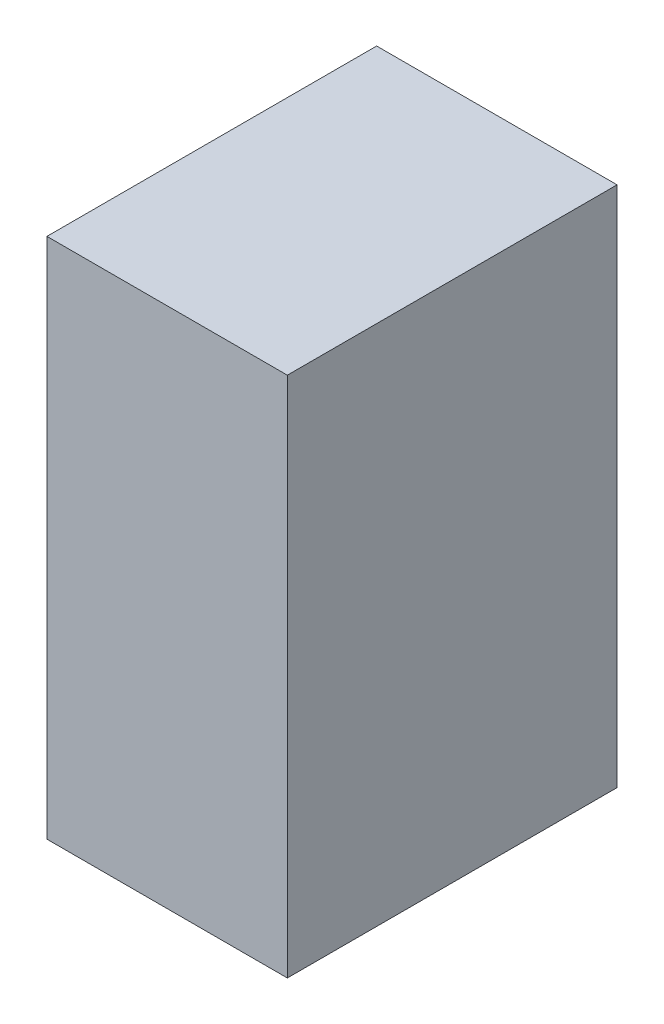
ISO-10303-21;
HEADER;
FILE_DESCRIPTION(('STEP AP214'),'2;1');
FILE_NAME('part.step','',(''),(''),'','','');
FILE_SCHEMA(('AUTOMOTIVE_DESIGN { 1 0 10303 214 1 1 1 1 }'));
ENDSEC;
DATA;
#1=APPLICATION_CONTEXT('core data for automotive mechanical design processes');
#2=APPLICATION_PROTOCOL_DEFINITION('international standard','automotive_design',2000,#1);
#3=PRODUCT_CONTEXT('',#1,'mechanical');
#4=PRODUCT('Part','Part','',(#3));
#5=PRODUCT_RELATED_PRODUCT_CATEGORY('part','',(#4));
#6=PRODUCT_DEFINITION_FORMATION('','',#4);
#7=PRODUCT_DEFINITION_CONTEXT('part definition',#1,'design');
#8=PRODUCT_DEFINITION('design','',#6,#7);
#9=PRODUCT_DEFINITION_SHAPE('','',#8);
#10=(LENGTH_UNIT() NAMED_UNIT(*) SI_UNIT(.MILLI.,.METRE.));
#11=(NAMED_UNIT(*) PLANE_ANGLE_UNIT() SI_UNIT($,.RADIAN.));
#12=(NAMED_UNIT(*) SI_UNIT($,.STERADIAN.) SOLID_ANGLE_UNIT());
#13=UNCERTAINTY_MEASURE_WITH_UNIT(LENGTH_MEASURE(1.E-05),#10,'distance_accuracy_value','');
#14=(GEOMETRIC_REPRESENTATION_CONTEXT(3) GLOBAL_UNCERTAINTY_ASSIGNED_CONTEXT((#13)) GLOBAL_UNIT_ASSIGNED_CONTEXT((#10,
#11,#12)) REPRESENTATION_CONTEXT('',''));
#15=CARTESIAN_POINT('',(0.,0.,0.));
#16=DIRECTION('',(0.,0.,1.));
#17=DIRECTION('',(1.,0.,0.));
#18=AXIS2_PLACEMENT_3D('',#15,#16,#17);
#19=CARTESIAN_POINT('',(17.5,76.,24.));
#20=DIRECTION('',(-1.,0.,0.));
#21=DIRECTION('',(0.,0.,1.));
#22=AXIS2_PLACEMENT_3D('',#19,#20,#21);
#23=PLANE('',#22);
#24=DIRECTION('',(0.,0.,-1.));
#25=VECTOR('',#24,1.);
#26=CARTESIAN_POINT('',(17.5,0.,24.));
#27=LINE('',#26,#25);
#28=CARTESIAN_POINT('',(17.5,0.,24.));
#29=VERTEX_POINT('',#28);
#30=CARTESIAN_POINT('',(17.5,0.,-24.));
#31=VERTEX_POINT('',#30);
#32=EDGE_CURVE('E97',#29,#31,#27,.T.);
#33=ORIENTED_EDGE('',*,*,#32,.T.);
#34=DIRECTION('',(0.,-1.,0.));
#35=VECTOR('',#34,1.);
#36=CARTESIAN_POINT('',(17.5,76.,-24.));
#37=LINE('',#36,#35);
#38=CARTESIAN_POINT('',(17.5,76.,-24.));
#39=VERTEX_POINT('',#38);
#40=EDGE_CURVE('E11',#39,#31,#37,.T.);
#41=ORIENTED_EDGE('',*,*,#40,.F.);
#42=DIRECTION('',(0.,0.,-1.));
#43=VECTOR('',#42,1.);
#44=CARTESIAN_POINT('',(17.5,76.,24.));
#45=LINE('',#44,#43);
#46=CARTESIAN_POINT('',(17.5,76.,24.));
#47=VERTEX_POINT('',#46);
#48=EDGE_CURVE('E85',#47,#39,#45,.T.);
#49=ORIENTED_EDGE('',*,*,#48,.F.);
#50=DIRECTION('',(0.,-1.,0.));
#51=VECTOR('',#50,1.);
#52=CARTESIAN_POINT('',(17.5,76.,24.));
#53=LINE('',#52,#51);
#54=EDGE_CURVE('E93',#47,#29,#53,.T.);
#55=ORIENTED_EDGE('',*,*,#54,.T.);
#56=EDGE_LOOP('',(#33,#41,#49,#55));
#57=FACE_BOUND('',#56,.T.);
#58=ADVANCED_FACE('F34',(#57),#23,.F.);
#59=CARTESIAN_POINT('',(-17.5,76.,-24.));
#60=DIRECTION('',(0.,0.,1.));
#61=DIRECTION('',(1.,0.,0.));
#62=AXIS2_PLACEMENT_3D('',#59,#60,#61);
#63=PLANE('',#62);
#64=DIRECTION('',(-1.,0.,0.));
#65=VECTOR('',#64,1.);
#66=CARTESIAN_POINT('',(-17.5,0.,-24.));
#67=LINE('',#66,#65);
#68=CARTESIAN_POINT('',(-17.5,0.,-24.));
#69=VERTEX_POINT('',#68);
#70=EDGE_CURVE('E89',#31,#69,#67,.T.);
#71=ORIENTED_EDGE('',*,*,#70,.T.);
#72=DIRECTION('',(0.,-1.,0.));
#73=VECTOR('',#72,1.);
#74=CARTESIAN_POINT('',(-17.5,76.,-24.));
#75=LINE('',#74,#73);
#76=CARTESIAN_POINT('',(-17.5,76.,-24.));
#77=VERTEX_POINT('',#76);
#78=EDGE_CURVE('E42',#77,#69,#75,.T.);
#79=ORIENTED_EDGE('',*,*,#78,.F.);
#80=DIRECTION('',(-1.,0.,0.));
#81=VECTOR('',#80,1.);
#82=CARTESIAN_POINT('',(-17.5,76.,-24.));
#83=LINE('',#82,#81);
#84=EDGE_CURVE('E80',#39,#77,#83,.T.);
#85=ORIENTED_EDGE('',*,*,#84,.F.);
#86=ORIENTED_EDGE('',*,*,#40,.T.);
#87=EDGE_LOOP('',(#71,#79,#85,#86));
#88=FACE_BOUND('',#87,.T.);
#89=ADVANCED_FACE('F88',(#88),#63,.F.);
#90=CARTESIAN_POINT('',(-17.5,76.,24.));
#91=DIRECTION('',(1.,0.,0.));
#92=DIRECTION('',(0.,0.,-1.));
#93=AXIS2_PLACEMENT_3D('',#90,#91,#92);
#94=PLANE('',#93);
#95=DIRECTION('',(0.,0.,1.));
#96=VECTOR('',#95,1.);
#97=CARTESIAN_POINT('',(-17.5,0.,24.));
#98=LINE('',#97,#96);
#99=CARTESIAN_POINT('',(-17.5,0.,24.));
#100=VERTEX_POINT('',#99);
#101=EDGE_CURVE('E67',#69,#100,#98,.T.);
#102=ORIENTED_EDGE('',*,*,#101,.T.);
#103=DIRECTION('',(0.,-1.,0.));
#104=VECTOR('',#103,1.);
#105=CARTESIAN_POINT('',(-17.5,76.,24.));
#106=LINE('',#105,#104);
#107=CARTESIAN_POINT('',(-17.5,76.,24.));
#108=VERTEX_POINT('',#107);
#109=EDGE_CURVE('E90',#108,#100,#106,.T.);
#110=ORIENTED_EDGE('',*,*,#109,.F.);
#111=DIRECTION('',(0.,0.,1.));
#112=VECTOR('',#111,1.);
#113=CARTESIAN_POINT('',(-17.5,76.,24.));
#114=LINE('',#113,#112);
#115=EDGE_CURVE('E83',#77,#108,#114,.T.);
#116=ORIENTED_EDGE('',*,*,#115,.F.);
#117=ORIENTED_EDGE('',*,*,#78,.T.);
#118=EDGE_LOOP('',(#102,#110,#116,#117));
#119=FACE_BOUND('',#118,.T.);
#120=ADVANCED_FACE('F91',(#119),#94,.F.);
#121=CARTESIAN_POINT('',(-17.5,76.,24.));
#122=DIRECTION('',(0.,0.,-1.));
#123=DIRECTION('',(-1.,0.,0.));
#124=AXIS2_PLACEMENT_3D('',#121,#122,#123);
#125=PLANE('',#124);
#126=DIRECTION('',(1.,0.,0.));
#127=VECTOR('',#126,1.);
#128=CARTESIAN_POINT('',(-17.5,0.,24.));
#129=LINE('',#128,#127);
#130=EDGE_CURVE('E73',#100,#29,#129,.T.);
#131=ORIENTED_EDGE('',*,*,#130,.T.);
#132=ORIENTED_EDGE('',*,*,#54,.F.);
#133=DIRECTION('',(1.,0.,0.));
#134=VECTOR('',#133,1.);
#135=CARTESIAN_POINT('',(-17.5,76.,24.));
#136=LINE('',#135,#134);
#137=EDGE_CURVE('E50',#108,#47,#136,.T.);
#138=ORIENTED_EDGE('',*,*,#137,.F.);
#139=ORIENTED_EDGE('',*,*,#109,.T.);
#140=EDGE_LOOP('',(#131,#132,#138,#139));
#141=FACE_BOUND('',#140,.T.);
#142=ADVANCED_FACE('F104',(#141),#125,.F.);
#143=CARTESIAN_POINT('',(0.,76.,0.));
#144=DIRECTION('',(0.,-1.,0.));
#145=DIRECTION('',(0.,0.,-1.));
#146=AXIS2_PLACEMENT_3D('',#143,#144,#145);
#147=PLANE('',#146);
#148=ORIENTED_EDGE('',*,*,#48,.T.);
#149=ORIENTED_EDGE('',*,*,#84,.T.);
#150=ORIENTED_EDGE('',*,*,#115,.T.);
#151=ORIENTED_EDGE('',*,*,#137,.T.);
#152=EDGE_LOOP('',(#148,#149,#150,#151));
#153=FACE_BOUND('',#152,.T.);
#154=ADVANCED_FACE('F81',(#153),#147,.F.);
#155=CARTESIAN_POINT('',(0.,0.,0.));
#156=DIRECTION('',(0.,-1.,0.));
#157=DIRECTION('',(0.,0.,-1.));
#158=AXIS2_PLACEMENT_3D('',#155,#156,#157);
#159=PLANE('',#158);
#160=ORIENTED_EDGE('',*,*,#32,.F.);
#161=ORIENTED_EDGE('',*,*,#130,.F.);
#162=ORIENTED_EDGE('',*,*,#101,.F.);
#163=ORIENTED_EDGE('',*,*,#70,.F.);
#164=EDGE_LOOP('',(#160,#161,#162,#163));
#165=FACE_BOUND('',#164,.T.);
#166=ADVANCED_FACE('F107',(#165),#159,.T.);
#167=CLOSED_SHELL('',(#58,#89,#120,#142,#154,#166));
#168=MANIFOLD_SOLID_BREP('B2',#167);
#169=ADVANCED_BREP_SHAPE_REPRESENTATION('',(#18,#168),#14);
#170=SHAPE_DEFINITION_REPRESENTATION(#9,#169);
ENDSEC;
END-ISO-10303-21;
